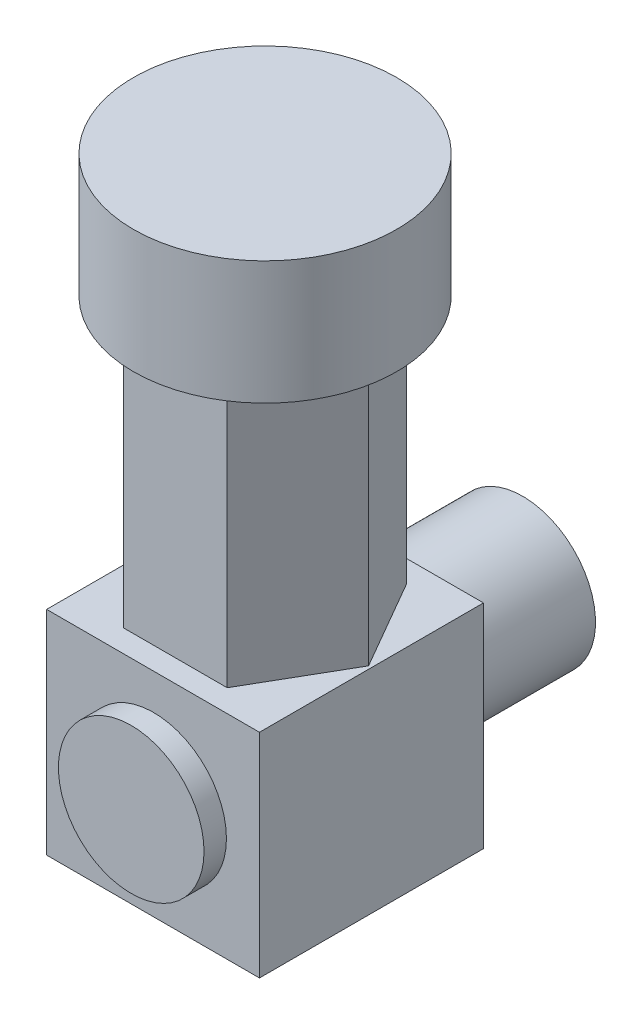
ISO-10303-21;
HEADER;
FILE_DESCRIPTION(('STEP AP214'),'2;1');
FILE_NAME('part.step','',(''),(''),'','','');
FILE_SCHEMA(('AUTOMOTIVE_DESIGN { 1 0 10303 214 1 1 1 1 }'));
ENDSEC;
DATA;
#1=APPLICATION_CONTEXT('core data for automotive mechanical design processes');
#2=APPLICATION_PROTOCOL_DEFINITION('international standard','automotive_design',2000,#1);
#3=PRODUCT_CONTEXT('',#1,'mechanical');
#4=PRODUCT('Part','Part','',(#3));
#5=PRODUCT_RELATED_PRODUCT_CATEGORY('part','',(#4));
#6=PRODUCT_DEFINITION_FORMATION('','',#4);
#7=PRODUCT_DEFINITION_CONTEXT('part definition',#1,'design');
#8=PRODUCT_DEFINITION('design','',#6,#7);
#9=PRODUCT_DEFINITION_SHAPE('','',#8);
#10=(LENGTH_UNIT() NAMED_UNIT(*) SI_UNIT(.MILLI.,.METRE.));
#11=(NAMED_UNIT(*) PLANE_ANGLE_UNIT() SI_UNIT($,.RADIAN.));
#12=(NAMED_UNIT(*) SI_UNIT($,.STERADIAN.) SOLID_ANGLE_UNIT());
#13=UNCERTAINTY_MEASURE_WITH_UNIT(LENGTH_MEASURE(1.E-05),#10,'distance_accuracy_value','');
#14=(GEOMETRIC_REPRESENTATION_CONTEXT(3) GLOBAL_UNCERTAINTY_ASSIGNED_CONTEXT((#13)) GLOBAL_UNIT_ASSIGNED_CONTEXT((#10,
#11,#12)) REPRESENTATION_CONTEXT('',''));
#15=CARTESIAN_POINT('',(0.,0.,0.));
#16=DIRECTION('',(0.,0.,1.));
#17=DIRECTION('',(1.,0.,0.));
#18=AXIS2_PLACEMENT_3D('',#15,#16,#17);
#19=CARTESIAN_POINT('',(9.7861661702534,44.2813807531381,18.));
#20=DIRECTION('',(-0.866025403784439,0.,-0.5));
#21=DIRECTION('',(-0.5,0.,0.866025403784439));
#22=AXIS2_PLACEMENT_3D('',#19,#20,#21);
#23=PLANE('',#22);
#24=DIRECTION('',(0.5,0.,-0.866025403784439));
#25=VECTOR('',#24,1.);
#26=CARTESIAN_POINT('',(9.7861661702534,33.2813807531381,18.));
#27=LINE('',#26,#25);
#28=CARTESIAN_POINT('',(9.7861661702534,33.2813807531381,18.));
#29=VERTEX_POINT('',#28);
#30=CARTESIAN_POINT('',(14.4049683237704,33.2813807531381,10.));
#31=VERTEX_POINT('',#30);
#32=EDGE_CURVE('E136',#29,#31,#27,.T.);
#33=ORIENTED_EDGE('',*,*,#32,.F.);
#34=DIRECTION('',(0.,-1.,0.));
#35=VECTOR('',#34,1.);
#36=CARTESIAN_POINT('',(9.7861661702534,44.2813807531381,18.));
#37=LINE('',#36,#35);
#38=CARTESIAN_POINT('',(9.7861661702534,9.28138075313808,18.));
#39=VERTEX_POINT('',#38);
#40=EDGE_CURVE('E123',#29,#39,#37,.T.);
#41=ORIENTED_EDGE('',*,*,#40,.T.);
#42=DIRECTION('',(0.5,0.,-0.866025403784439));
#43=VECTOR('',#42,1.);
#44=CARTESIAN_POINT('',(9.7861661702534,9.28138075313808,18.));
#45=LINE('',#44,#43);
#46=CARTESIAN_POINT('',(14.4049683237704,9.28138075313808,10.));
#47=VERTEX_POINT('',#46);
#48=EDGE_CURVE('E140',#39,#47,#45,.T.);
#49=ORIENTED_EDGE('',*,*,#48,.T.);
#50=DIRECTION('',(0.,-1.,0.));
#51=VECTOR('',#50,1.);
#52=CARTESIAN_POINT('',(14.4049683237704,44.2813807531381,10.));
#53=LINE('',#52,#51);
#54=EDGE_CURVE('E137',#31,#47,#53,.T.);
#55=ORIENTED_EDGE('',*,*,#54,.F.);
#56=EDGE_LOOP('',(#33,#41,#49,#55));
#57=FACE_BOUND('',#56,.T.);
#58=ADVANCED_FACE('F45',(#57),#23,.F.);
#59=CARTESIAN_POINT('',(14.4049683237704,44.2813807531381,10.));
#60=DIRECTION('',(-0.866025403784438,0.,0.5));
#61=DIRECTION('',(0.5,0.,0.866025403784438));
#62=AXIS2_PLACEMENT_3D('',#59,#60,#61);
#63=PLANE('',#62);
#64=DIRECTION('',(-0.5,0.,-0.866025403784438));
#65=VECTOR('',#64,1.);
#66=CARTESIAN_POINT('',(14.4049683237704,33.2813807531381,10.));
#67=LINE('',#66,#65);
#68=CARTESIAN_POINT('',(9.7861661702534,33.2813807531381,2.));
#69=VERTEX_POINT('',#68);
#70=EDGE_CURVE('E61',#31,#69,#67,.T.);
#71=ORIENTED_EDGE('',*,*,#70,.F.);
#72=ORIENTED_EDGE('',*,*,#54,.T.);
#73=DIRECTION('',(-0.5,0.,-0.866025403784438));
#74=VECTOR('',#73,1.);
#75=CARTESIAN_POINT('',(14.4049683237704,9.28138075313808,10.));
#76=LINE('',#75,#74);
#77=CARTESIAN_POINT('',(9.7861661702534,9.28138075313808,2.));
#78=VERTEX_POINT('',#77);
#79=EDGE_CURVE('E166',#47,#78,#76,.T.);
#80=ORIENTED_EDGE('',*,*,#79,.T.);
#81=DIRECTION('',(0.,-1.,0.));
#82=VECTOR('',#81,1.);
#83=CARTESIAN_POINT('',(9.7861661702534,44.2813807531381,2.));
#84=LINE('',#83,#82);
#85=EDGE_CURVE('E192',#69,#78,#84,.T.);
#86=ORIENTED_EDGE('',*,*,#85,.F.);
#87=EDGE_LOOP('',(#71,#72,#80,#86));
#88=FACE_BOUND('',#87,.T.);
#89=ADVANCED_FACE('F289',(#88),#63,.F.);
#90=CARTESIAN_POINT('',(9.7861661702534,44.2813807531381,2.));
#91=DIRECTION('',(0.,0.,1.));
#92=DIRECTION('',(1.,0.,0.));
#93=AXIS2_PLACEMENT_3D('',#90,#91,#92);
#94=PLANE('',#93);
#95=DIRECTION('',(-1.,0.,0.));
#96=VECTOR('',#95,1.);
#97=CARTESIAN_POINT('',(9.7861661702534,33.2813807531381,2.));
#98=LINE('',#97,#96);
#99=CARTESIAN_POINT('',(0.548561863219393,33.2813807531381,2.));
#100=VERTEX_POINT('',#99);
#101=EDGE_CURVE('E69',#69,#100,#98,.T.);
#102=ORIENTED_EDGE('',*,*,#101,.F.);
#103=ORIENTED_EDGE('',*,*,#85,.T.);
#104=DIRECTION('',(-1.,0.,0.));
#105=VECTOR('',#104,1.);
#106=CARTESIAN_POINT('',(9.7861661702534,9.28138075313808,2.));
#107=LINE('',#106,#105);
#108=CARTESIAN_POINT('',(0.548561863219393,9.28138075313808,2.));
#109=VERTEX_POINT('',#108);
#110=EDGE_CURVE('E170',#78,#109,#107,.T.);
#111=ORIENTED_EDGE('',*,*,#110,.T.);
#112=DIRECTION('',(0.,-1.,0.));
#113=VECTOR('',#112,1.);
#114=CARTESIAN_POINT('',(0.548561863219393,44.2813807531381,2.));
#115=LINE('',#114,#113);
#116=EDGE_CURVE('E189',#100,#109,#115,.T.);
#117=ORIENTED_EDGE('',*,*,#116,.F.);
#118=EDGE_LOOP('',(#102,#103,#111,#117));
#119=FACE_BOUND('',#118,.T.);
#120=ADVANCED_FACE('F295',(#119),#94,.F.);
#121=CARTESIAN_POINT('',(0.548561863219393,44.2813807531381,2.));
#122=DIRECTION('',(0.866025403784439,0.,0.5));
#123=DIRECTION('',(0.5,0.,-0.866025403784439));
#124=AXIS2_PLACEMENT_3D('',#121,#122,#123);
#125=PLANE('',#124);
#126=DIRECTION('',(-0.5,0.,0.866025403784439));
#127=VECTOR('',#126,1.);
#128=CARTESIAN_POINT('',(0.548561863219393,33.2813807531381,2.));
#129=LINE('',#128,#127);
#130=CARTESIAN_POINT('',(-4.07024029029761,33.2813807531381,10.));
#131=VERTEX_POINT('',#130);
#132=EDGE_CURVE('E146',#100,#131,#129,.T.);
#133=ORIENTED_EDGE('',*,*,#132,.F.);
#134=ORIENTED_EDGE('',*,*,#116,.T.);
#135=DIRECTION('',(-0.5,0.,0.866025403784439));
#136=VECTOR('',#135,1.);
#137=CARTESIAN_POINT('',(0.548561863219393,9.28138075313808,2.));
#138=LINE('',#137,#136);
#139=CARTESIAN_POINT('',(-4.07024029029761,9.28138075313808,10.));
#140=VERTEX_POINT('',#139);
#141=EDGE_CURVE('E174',#109,#140,#138,.T.);
#142=ORIENTED_EDGE('',*,*,#141,.T.);
#143=DIRECTION('',(0.,-1.,0.));
#144=VECTOR('',#143,1.);
#145=CARTESIAN_POINT('',(-4.07024029029761,44.2813807531381,10.));
#146=LINE('',#145,#144);
#147=EDGE_CURVE('E186',#131,#140,#146,.T.);
#148=ORIENTED_EDGE('',*,*,#147,.F.);
#149=EDGE_LOOP('',(#133,#134,#142,#148));
#150=FACE_BOUND('',#149,.T.);
#151=ADVANCED_FACE('F372',(#150),#125,.F.);
#152=CARTESIAN_POINT('',(-4.07024029029761,44.2813807531381,10.));
#153=DIRECTION('',(0.866025403784439,0.,-0.5));
#154=DIRECTION('',(-0.5,0.,-0.866025403784439));
#155=AXIS2_PLACEMENT_3D('',#152,#153,#154);
#156=PLANE('',#155);
#157=DIRECTION('',(0.5,0.,0.866025403784439));
#158=VECTOR('',#157,1.);
#159=CARTESIAN_POINT('',(-4.07024029029761,33.2813807531381,10.));
#160=LINE('',#159,#158);
#161=CARTESIAN_POINT('',(0.548561863219396,33.2813807531381,18.));
#162=VERTEX_POINT('',#161);
#163=EDGE_CURVE('E145',#131,#162,#160,.T.);
#164=ORIENTED_EDGE('',*,*,#163,.F.);
#165=ORIENTED_EDGE('',*,*,#147,.T.);
#166=DIRECTION('',(0.5,0.,0.866025403784439));
#167=VECTOR('',#166,1.);
#168=CARTESIAN_POINT('',(-4.07024029029761,9.28138075313808,10.));
#169=LINE('',#168,#167);
#170=CARTESIAN_POINT('',(0.548561863219396,9.28138075313808,18.));
#171=VERTEX_POINT('',#170);
#172=EDGE_CURVE('E178',#140,#171,#169,.T.);
#173=ORIENTED_EDGE('',*,*,#172,.T.);
#174=DIRECTION('',(0.,-1.,0.));
#175=VECTOR('',#174,1.);
#176=CARTESIAN_POINT('',(0.548561863219396,44.2813807531381,18.));
#177=LINE('',#176,#175);
#178=EDGE_CURVE('E133',#162,#171,#177,.T.);
#179=ORIENTED_EDGE('',*,*,#178,.F.);
#180=EDGE_LOOP('',(#164,#165,#173,#179));
#181=FACE_BOUND('',#180,.T.);
#182=ADVANCED_FACE('F362',(#181),#156,.F.);
#183=CARTESIAN_POINT('',(0.548561863219396,44.2813807531381,18.));
#184=DIRECTION('',(0.,0.,-1.));
#185=DIRECTION('',(-1.,0.,0.));
#186=AXIS2_PLACEMENT_3D('',#183,#184,#185);
#187=PLANE('',#186);
#188=DIRECTION('',(1.,0.,0.));
#189=VECTOR('',#188,1.);
#190=CARTESIAN_POINT('',(0.548561863219396,33.2813807531381,18.));
#191=LINE('',#190,#189);
#192=EDGE_CURVE('E11',#162,#29,#191,.T.);
#193=ORIENTED_EDGE('',*,*,#192,.F.);
#194=ORIENTED_EDGE('',*,*,#178,.T.);
#195=DIRECTION('',(1.,0.,0.));
#196=VECTOR('',#195,1.);
#197=CARTESIAN_POINT('',(0.548561863219396,9.28138075313808,18.));
#198=LINE('',#197,#196);
#199=EDGE_CURVE('E128',#171,#39,#198,.T.);
#200=ORIENTED_EDGE('',*,*,#199,.T.);
#201=ORIENTED_EDGE('',*,*,#40,.F.);
#202=EDGE_LOOP('',(#193,#194,#200,#201));
#203=FACE_BOUND('',#202,.T.);
#204=ADVANCED_FACE('F125',(#203),#187,.F.);
#205=CARTESIAN_POINT('',(-4.3326359832636,9.28138075313808,20.));
#206=DIRECTION('',(0.,-1.,0.));
#207=DIRECTION('',(0.,0.,-1.));
#208=AXIS2_PLACEMENT_3D('',#205,#206,#207);
#209=PLANE('',#208);
#210=DIRECTION('',(-1.,0.,0.));
#211=VECTOR('',#210,1.);
#212=CARTESIAN_POINT('',(-4.3326359832636,9.28138075313808,0.));
#213=LINE('',#212,#211);
#214=CARTESIAN_POINT('',(14.6673640167364,9.28138075313808,0.));
#215=VERTEX_POINT('',#214);
#216=CARTESIAN_POINT('',(-4.3326359832636,9.28138075313808,0.));
#217=VERTEX_POINT('',#216);
#218=EDGE_CURVE('E219',#215,#217,#213,.T.);
#219=ORIENTED_EDGE('',*,*,#218,.T.);
#220=DIRECTION('',(0.,0.,-1.));
#221=VECTOR('',#220,1.);
#222=CARTESIAN_POINT('',(-4.3326359832636,9.28138075313808,20.));
#223=LINE('',#222,#221);
#224=CARTESIAN_POINT('',(-4.3326359832636,9.28138075313808,20.));
#225=VERTEX_POINT('',#224);
#226=EDGE_CURVE('E228',#225,#217,#223,.T.);
#227=ORIENTED_EDGE('',*,*,#226,.F.);
#228=DIRECTION('',(-1.,0.,0.));
#229=VECTOR('',#228,1.);
#230=CARTESIAN_POINT('',(-4.3326359832636,9.28138075313808,20.));
#231=LINE('',#230,#229);
#232=CARTESIAN_POINT('',(14.6673640167364,9.28138075313808,20.));
#233=VERTEX_POINT('',#232);
#234=EDGE_CURVE('E225',#233,#225,#231,.T.);
#235=ORIENTED_EDGE('',*,*,#234,.F.);
#236=DIRECTION('',(0.,0.,-1.));
#237=VECTOR('',#236,1.);
#238=CARTESIAN_POINT('',(14.6673640167364,9.28138075313808,20.));
#239=LINE('',#238,#237);
#240=EDGE_CURVE('E243',#233,#215,#239,.T.);
#241=ORIENTED_EDGE('',*,*,#240,.T.);
#242=EDGE_LOOP('',(#219,#227,#235,#241));
#243=FACE_BOUND('',#242,.T.);
#244=ORIENTED_EDGE('',*,*,#48,.F.);
#245=ORIENTED_EDGE('',*,*,#199,.F.);
#246=ORIENTED_EDGE('',*,*,#172,.F.);
#247=ORIENTED_EDGE('',*,*,#141,.F.);
#248=ORIENTED_EDGE('',*,*,#110,.F.);
#249=ORIENTED_EDGE('',*,*,#79,.F.);
#250=EDGE_LOOP('',(#244,#245,#246,#247,#248,#249));
#251=FACE_BOUND('',#250,.T.);
#252=ADVANCED_FACE('F270',(#243,#251),#209,.F.);
#253=CARTESIAN_POINT('',(-4.3326359832636,9.28138075313808,20.));
#254=DIRECTION('',(1.,0.,0.));
#255=DIRECTION('',(0.,1.,0.));
#256=AXIS2_PLACEMENT_3D('',#253,#254,#255);
#257=PLANE('',#256);
#258=DIRECTION('',(0.,-1.,0.));
#259=VECTOR('',#258,1.);
#260=CARTESIAN_POINT('',(-4.3326359832636,9.28138075313808,0.));
#261=LINE('',#260,#259);
#262=CARTESIAN_POINT('',(-4.3326359832636,-9.71861924686192,0.));
#263=VERTEX_POINT('',#262);
#264=EDGE_CURVE('E209',#217,#263,#261,.T.);
#265=ORIENTED_EDGE('',*,*,#264,.T.);
#266=DIRECTION('',(0.,0.,-1.));
#267=VECTOR('',#266,1.);
#268=CARTESIAN_POINT('',(-4.3326359832636,-9.71861924686192,20.));
#269=LINE('',#268,#267);
#270=CARTESIAN_POINT('',(-4.3326359832636,-9.71861924686192,20.));
#271=VERTEX_POINT('',#270);
#272=EDGE_CURVE('E213',#271,#263,#269,.T.);
#273=ORIENTED_EDGE('',*,*,#272,.F.);
#274=DIRECTION('',(0.,-1.,0.));
#275=VECTOR('',#274,1.);
#276=CARTESIAN_POINT('',(-4.3326359832636,9.28138075313808,20.));
#277=LINE('',#276,#275);
#278=EDGE_CURVE('E214',#225,#271,#277,.T.);
#279=ORIENTED_EDGE('',*,*,#278,.F.);
#280=ORIENTED_EDGE('',*,*,#226,.T.);
#281=EDGE_LOOP('',(#265,#273,#279,#280));
#282=FACE_BOUND('',#281,.T.);
#283=ADVANCED_FACE('F47',(#282),#257,.F.);
#284=CARTESIAN_POINT('',(-4.3326359832636,-9.71861924686192,20.));
#285=DIRECTION('',(0.,1.,0.));
#286=DIRECTION('',(0.,0.,1.));
#287=AXIS2_PLACEMENT_3D('',#284,#285,#286);
#288=PLANE('',#287);
#289=DIRECTION('',(1.,0.,0.));
#290=VECTOR('',#289,1.);
#291=CARTESIAN_POINT('',(-4.3326359832636,-9.71861924686192,0.));
#292=LINE('',#291,#290);
#293=CARTESIAN_POINT('',(14.6673640167364,-9.71861924686192,0.));
#294=VERTEX_POINT('',#293);
#295=EDGE_CURVE('E232',#263,#294,#292,.T.);
#296=ORIENTED_EDGE('',*,*,#295,.T.);
#297=DIRECTION('',(0.,0.,-1.));
#298=VECTOR('',#297,1.);
#299=CARTESIAN_POINT('',(14.6673640167364,-9.71861924686192,20.));
#300=LINE('',#299,#298);
#301=CARTESIAN_POINT('',(14.6673640167364,-9.71861924686192,20.));
#302=VERTEX_POINT('',#301);
#303=EDGE_CURVE('E247',#302,#294,#300,.T.);
#304=ORIENTED_EDGE('',*,*,#303,.F.);
#305=DIRECTION('',(1.,0.,0.));
#306=VECTOR('',#305,1.);
#307=CARTESIAN_POINT('',(-4.3326359832636,-9.71861924686192,20.));
#308=LINE('',#307,#306);
#309=EDGE_CURVE('E218',#271,#302,#308,.T.);
#310=ORIENTED_EDGE('',*,*,#309,.F.);
#311=ORIENTED_EDGE('',*,*,#272,.T.);
#312=EDGE_LOOP('',(#296,#304,#310,#311));
#313=FACE_BOUND('',#312,.T.);
#314=ADVANCED_FACE('F254',(#313),#288,.F.);
#315=CARTESIAN_POINT('',(14.6673640167364,9.28138075313808,20.));
#316=DIRECTION('',(-1.,0.,0.));
#317=DIRECTION('',(0.,0.,1.));
#318=AXIS2_PLACEMENT_3D('',#315,#316,#317);
#319=PLANE('',#318);
#320=DIRECTION('',(0.,1.,0.));
#321=VECTOR('',#320,1.);
#322=CARTESIAN_POINT('',(14.6673640167364,9.28138075313808,0.));
#323=LINE('',#322,#321);
#324=EDGE_CURVE('E235',#294,#215,#323,.T.);
#325=ORIENTED_EDGE('',*,*,#324,.T.);
#326=ORIENTED_EDGE('',*,*,#240,.F.);
#327=DIRECTION('',(0.,1.,0.));
#328=VECTOR('',#327,1.);
#329=CARTESIAN_POINT('',(14.6673640167364,9.28138075313808,20.));
#330=LINE('',#329,#328);
#331=EDGE_CURVE('E222',#302,#233,#330,.T.);
#332=ORIENTED_EDGE('',*,*,#331,.F.);
#333=ORIENTED_EDGE('',*,*,#303,.T.);
#334=EDGE_LOOP('',(#325,#326,#332,#333));
#335=FACE_BOUND('',#334,.T.);
#336=ADVANCED_FACE('F266',(#335),#319,.F.);
#337=CARTESIAN_POINT('',(0.,0.,20.));
#338=DIRECTION('',(0.,0.,1.));
#339=DIRECTION('',(1.,0.,0.));
#340=AXIS2_PLACEMENT_3D('',#337,#338,#339);
#341=PLANE('',#340);
#342=CARTESIAN_POINT('',(5.21896373240999,-0.412118180637834,20.));
#343=DIRECTION('',(0.,0.,1.));
#344=DIRECTION('',(1.,0.,0.));
#345=AXIS2_PLACEMENT_3D('',#342,#343,#344);
#346=CIRCLE('',#345,6.5);
#347=CARTESIAN_POINT('',(11.71896373241,-0.412118180637834,20.));
#348=VERTEX_POINT('',#347);
#349=EDGE_CURVE('E205',#348,#348,#346,.T.);
#350=ORIENTED_EDGE('',*,*,#349,.F.);
#351=EDGE_LOOP('',(#350));
#352=FACE_BOUND('',#351,.T.);
#353=ORIENTED_EDGE('',*,*,#278,.T.);
#354=ORIENTED_EDGE('',*,*,#309,.T.);
#355=ORIENTED_EDGE('',*,*,#331,.T.);
#356=ORIENTED_EDGE('',*,*,#234,.T.);
#357=EDGE_LOOP('',(#353,#354,#355,#356));
#358=FACE_BOUND('',#357,.T.);
#359=ADVANCED_FACE('F273',(#352,#358),#341,.T.);
#360=CARTESIAN_POINT('',(0.,0.,0.));
#361=DIRECTION('',(0.,0.,1.));
#362=DIRECTION('',(1.,0.,0.));
#363=AXIS2_PLACEMENT_3D('',#360,#361,#362);
#364=PLANE('',#363);
#365=CARTESIAN_POINT('',(5.1673640167364,-0.218619246861921,0.));
#366=DIRECTION('',(0.,0.,-1.));
#367=DIRECTION('',(-1.,0.,0.));
#368=AXIS2_PLACEMENT_3D('',#365,#366,#367);
#369=CIRCLE('',#368,6.5);
#370=CARTESIAN_POINT('',(-1.3326359832636,-0.218619246861921,0.));
#371=VERTEX_POINT('',#370);
#372=EDGE_CURVE('E54',#371,#371,#369,.T.);
#373=ORIENTED_EDGE('',*,*,#372,.F.);
#374=EDGE_LOOP('',(#373));
#375=FACE_BOUND('',#374,.T.);
#376=ORIENTED_EDGE('',*,*,#264,.F.);
#377=ORIENTED_EDGE('',*,*,#218,.F.);
#378=ORIENTED_EDGE('',*,*,#324,.F.);
#379=ORIENTED_EDGE('',*,*,#295,.F.);
#380=EDGE_LOOP('',(#376,#377,#378,#379));
#381=FACE_BOUND('',#380,.T.);
#382=ADVANCED_FACE('F262',(#375,#381),#364,.F.);
#383=CARTESIAN_POINT('',(5.21896373240999,-0.412118180637834,22.));
#384=DIRECTION('',(0.,0.,-1.));
#385=DIRECTION('',(-1.,0.,0.));
#386=AXIS2_PLACEMENT_3D('',#383,#384,#385);
#387=CYLINDRICAL_SURFACE('',#386,6.5);
#388=CARTESIAN_POINT('',(5.21896373240999,-0.412118180637834,22.));
#389=DIRECTION('',(0.,0.,1.));
#390=DIRECTION('',(1.,0.,0.));
#391=AXIS2_PLACEMENT_3D('',#388,#389,#390);
#392=CIRCLE('',#391,6.5);
#393=CARTESIAN_POINT('',(11.71896373241,-0.412118180637834,22.));
#394=VERTEX_POINT('',#393);
#395=EDGE_CURVE('E201',#394,#394,#392,.T.);
#396=ORIENTED_EDGE('',*,*,#395,.F.);
#397=EDGE_LOOP('',(#396));
#398=FACE_BOUND('',#397,.T.);
#399=ORIENTED_EDGE('',*,*,#349,.T.);
#400=EDGE_LOOP('',(#399));
#401=FACE_BOUND('',#400,.T.);
#402=ADVANCED_FACE('F282',(#398,#401),#387,.T.);
#403=CARTESIAN_POINT('',(5.21896373240999,-0.412118180637834,22.));
#404=DIRECTION('',(0.,0.,1.));
#405=DIRECTION('',(1.,0.,0.));
#406=AXIS2_PLACEMENT_3D('',#403,#404,#405);
#407=PLANE('',#406);
#408=ORIENTED_EDGE('',*,*,#395,.T.);
#409=EDGE_LOOP('',(#408));
#410=FACE_BOUND('',#409,.T.);
#411=ADVANCED_FACE('F306',(#410),#407,.T.);
#412=CARTESIAN_POINT('',(5.1673640167364,-0.218619246861921,-13.));
#413=DIRECTION('',(0.,0.,1.));
#414=DIRECTION('',(1.,0.,0.));
#415=AXIS2_PLACEMENT_3D('',#412,#413,#414);
#416=CYLINDRICAL_SURFACE('',#415,6.5);
#417=CARTESIAN_POINT('',(5.1673640167364,-0.218619246861921,-13.));
#418=DIRECTION('',(0.,0.,-1.));
#419=DIRECTION('',(-1.,0.,0.));
#420=AXIS2_PLACEMENT_3D('',#417,#418,#419);
#421=CIRCLE('',#420,6.5);
#422=CARTESIAN_POINT('',(-1.3326359832636,-0.218619246861921,-13.));
#423=VERTEX_POINT('',#422);
#424=EDGE_CURVE('E197',#423,#423,#421,.T.);
#425=ORIENTED_EDGE('',*,*,#424,.F.);
#426=EDGE_LOOP('',(#425));
#427=FACE_BOUND('',#426,.T.);
#428=ORIENTED_EDGE('',*,*,#372,.T.);
#429=EDGE_LOOP('',(#428));
#430=FACE_BOUND('',#429,.T.);
#431=ADVANCED_FACE('F302',(#427,#430),#416,.T.);
#432=CARTESIAN_POINT('',(5.1673640167364,-0.218619246861921,-13.));
#433=DIRECTION('',(0.,0.,-1.));
#434=DIRECTION('',(-1.,0.,0.));
#435=AXIS2_PLACEMENT_3D('',#432,#433,#434);
#436=PLANE('',#435);
#437=ORIENTED_EDGE('',*,*,#424,.T.);
#438=EDGE_LOOP('',(#437));
#439=FACE_BOUND('',#438,.T.);
#440=ADVANCED_FACE('F299',(#439),#436,.T.);
#441=CARTESIAN_POINT('',(5.1673640167364,33.2813807531381,10.));
#442=DIRECTION('',(0.,1.,0.));
#443=DIRECTION('',(0.,0.,1.));
#444=AXIS2_PLACEMENT_3D('',#441,#442,#443);
#445=PLANE('',#444);
#446=CARTESIAN_POINT('',(5.1673640167364,33.2813807531381,10.));
#447=DIRECTION('',(0.,1.,0.));
#448=DIRECTION('',(0.,0.,1.));
#449=AXIS2_PLACEMENT_3D('',#446,#447,#448);
#450=CIRCLE('',#449,11.75);
#451=CARTESIAN_POINT('',(5.1673640167364,33.2813807531381,21.75));
#452=VERTEX_POINT('',#451);
#453=EDGE_CURVE('E150',#452,#452,#450,.T.);
#454=ORIENTED_EDGE('',*,*,#453,.F.);
#455=EDGE_LOOP('',(#454));
#456=FACE_BOUND('',#455,.T.);
#457=ORIENTED_EDGE('',*,*,#192,.T.);
#458=ORIENTED_EDGE('',*,*,#32,.T.);
#459=ORIENTED_EDGE('',*,*,#70,.T.);
#460=ORIENTED_EDGE('',*,*,#101,.T.);
#461=ORIENTED_EDGE('',*,*,#132,.T.);
#462=ORIENTED_EDGE('',*,*,#163,.T.);
#463=EDGE_LOOP('',(#457,#458,#459,#460,#461,#462));
#464=FACE_BOUND('',#463,.T.);
#465=ADVANCED_FACE('F143',(#456,#464),#445,.F.);
#466=CARTESIAN_POINT('',(5.1673640167364,33.2813807531381,10.));
#467=DIRECTION('',(0.,1.,0.));
#468=DIRECTION('',(0.,0.,1.));
#469=AXIS2_PLACEMENT_3D('',#466,#467,#468);
#470=CYLINDRICAL_SURFACE('',#469,11.75);
#471=ORIENTED_EDGE('',*,*,#453,.T.);
#472=EDGE_LOOP('',(#471));
#473=FACE_BOUND('',#472,.T.);
#474=CARTESIAN_POINT('',(5.1673640167364,44.2813807531381,10.));
#475=DIRECTION('',(0.,1.,0.));
#476=DIRECTION('',(0.,0.,1.));
#477=AXIS2_PLACEMENT_3D('',#474,#475,#476);
#478=CIRCLE('',#477,11.75);
#479=CARTESIAN_POINT('',(5.1673640167364,44.2813807531381,21.75));
#480=VERTEX_POINT('',#479);
#481=EDGE_CURVE('E156',#480,#480,#478,.T.);
#482=ORIENTED_EDGE('',*,*,#481,.F.);
#483=EDGE_LOOP('',(#482));
#484=FACE_BOUND('',#483,.T.);
#485=ADVANCED_FACE('F352',(#473,#484),#470,.T.);
#486=CARTESIAN_POINT('',(0.,44.2813807531381,0.));
#487=DIRECTION('',(0.,1.,0.));
#488=DIRECTION('',(0.,0.,1.));
#489=AXIS2_PLACEMENT_3D('',#486,#487,#488);
#490=PLANE('',#489);
#491=ORIENTED_EDGE('',*,*,#481,.T.);
#492=EDGE_LOOP('',(#491));
#493=FACE_BOUND('',#492,.T.);
#494=ADVANCED_FACE('F348',(#493),#490,.T.);
#495=CLOSED_SHELL('',(#58,#89,#120,#151,#182,#204,#252,#283,#314,#336,#359,#382,#402,#411,#431,
#440,#465,#485,#494));
#496=MANIFOLD_SOLID_BREP('B2',#495);
#497=ADVANCED_BREP_SHAPE_REPRESENTATION('',(#18,#496),#14);
#498=SHAPE_DEFINITION_REPRESENTATION(#9,#497);
ENDSEC;
END-ISO-10303-21;
